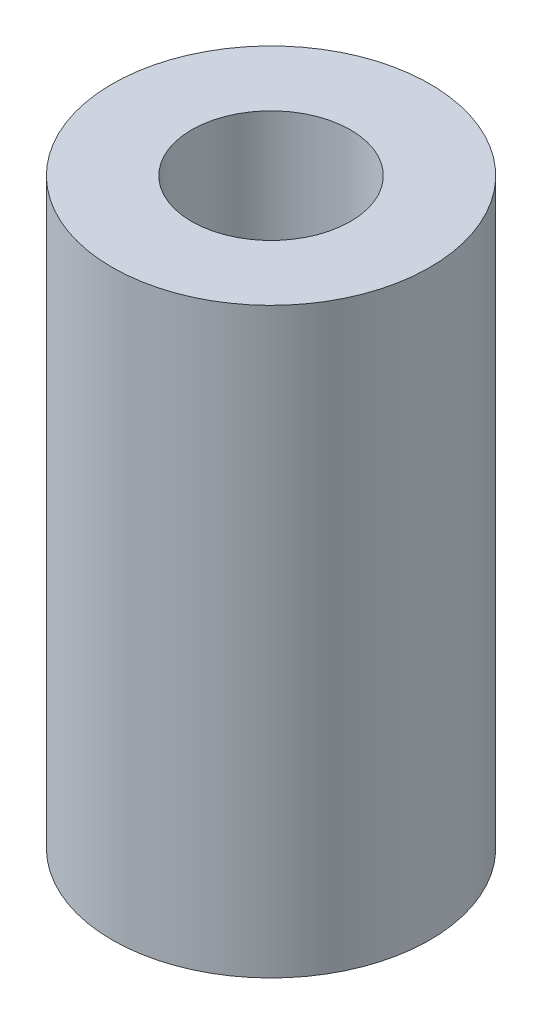
ISO-10303-21;
HEADER;
FILE_DESCRIPTION(('STEP AP214'),'2;1');
FILE_NAME('part.step','',(''),(''),'','','');
FILE_SCHEMA(('AUTOMOTIVE_DESIGN { 1 0 10303 214 1 1 1 1 }'));
ENDSEC;
DATA;
#1=APPLICATION_CONTEXT('core data for automotive mechanical design processes');
#2=APPLICATION_PROTOCOL_DEFINITION('international standard','automotive_design',2000,#1);
#3=PRODUCT_CONTEXT('',#1,'mechanical');
#4=PRODUCT('Part','Part','',(#3));
#5=PRODUCT_RELATED_PRODUCT_CATEGORY('part','',(#4));
#6=PRODUCT_DEFINITION_FORMATION('','',#4);
#7=PRODUCT_DEFINITION_CONTEXT('part definition',#1,'design');
#8=PRODUCT_DEFINITION('design','',#6,#7);
#9=PRODUCT_DEFINITION_SHAPE('','',#8);
#10=(LENGTH_UNIT() NAMED_UNIT(*) SI_UNIT(.MILLI.,.METRE.));
#11=(NAMED_UNIT(*) PLANE_ANGLE_UNIT() SI_UNIT($,.RADIAN.));
#12=(NAMED_UNIT(*) SI_UNIT($,.STERADIAN.) SOLID_ANGLE_UNIT());
#13=UNCERTAINTY_MEASURE_WITH_UNIT(LENGTH_MEASURE(1.E-05),#10,'distance_accuracy_value','');
#14=(GEOMETRIC_REPRESENTATION_CONTEXT(3) GLOBAL_UNCERTAINTY_ASSIGNED_CONTEXT((#13)) GLOBAL_UNIT_ASSIGNED_CONTEXT((#10,
#11,#12)) REPRESENTATION_CONTEXT('',''));
#15=CARTESIAN_POINT('',(0.,0.,0.));
#16=DIRECTION('',(0.,0.,1.));
#17=DIRECTION('',(1.,0.,0.));
#18=AXIS2_PLACEMENT_3D('',#15,#16,#17);
#19=CARTESIAN_POINT('',(0.,22.,0.));
#20=DIRECTION('',(0.,-1.,0.));
#21=DIRECTION('',(0.,0.,-1.));
#22=AXIS2_PLACEMENT_3D('',#19,#20,#21);
#23=CYLINDRICAL_SURFACE('',#22,6.);
#24=CARTESIAN_POINT('',(0.,22.,0.));
#25=DIRECTION('',(0.,1.,0.));
#26=DIRECTION('',(0.,0.,1.));
#27=AXIS2_PLACEMENT_3D('',#24,#25,#26);
#28=CIRCLE('',#27,6.);
#29=CARTESIAN_POINT('',(0.,22.,6.));
#30=VERTEX_POINT('',#29);
#31=EDGE_CURVE('E12',#30,#30,#28,.T.);
#32=ORIENTED_EDGE('',*,*,#31,.F.);
#33=EDGE_LOOP('',(#32));
#34=FACE_BOUND('',#33,.T.);
#35=CARTESIAN_POINT('',(0.,0.,0.));
#36=DIRECTION('',(0.,1.,0.));
#37=DIRECTION('',(0.,0.,1.));
#38=AXIS2_PLACEMENT_3D('',#35,#36,#37);
#39=CIRCLE('',#38,6.);
#40=CARTESIAN_POINT('',(0.,0.,6.));
#41=VERTEX_POINT('',#40);
#42=EDGE_CURVE('E47',#41,#41,#39,.T.);
#43=ORIENTED_EDGE('',*,*,#42,.T.);
#44=EDGE_LOOP('',(#43));
#45=FACE_BOUND('',#44,.T.);
#46=ADVANCED_FACE('F44',(#34,#45),#23,.T.);
#47=CARTESIAN_POINT('',(0.,22.,0.));
#48=DIRECTION('',(0.,1.,0.));
#49=DIRECTION('',(0.,0.,1.));
#50=AXIS2_PLACEMENT_3D('',#47,#48,#49);
#51=PLANE('',#50);
#52=CARTESIAN_POINT('',(0.,22.,0.));
#53=DIRECTION('',(0.,1.,0.));
#54=DIRECTION('',(0.,0.,1.));
#55=AXIS2_PLACEMENT_3D('',#52,#53,#54);
#56=CIRCLE('',#55,3.);
#57=CARTESIAN_POINT('',(0.,22.,3.));
#58=VERTEX_POINT('',#57);
#59=EDGE_CURVE('E56',#58,#58,#56,.T.);
#60=ORIENTED_EDGE('',*,*,#59,.F.);
#61=EDGE_LOOP('',(#60));
#62=FACE_BOUND('',#61,.T.);
#63=ORIENTED_EDGE('',*,*,#31,.T.);
#64=EDGE_LOOP('',(#63));
#65=FACE_BOUND('',#64,.T.);
#66=ADVANCED_FACE('F71',(#62,#65),#51,.T.);
#67=CARTESIAN_POINT('',(0.,0.,0.));
#68=DIRECTION('',(0.,1.,0.));
#69=DIRECTION('',(0.,0.,1.));
#70=AXIS2_PLACEMENT_3D('',#67,#68,#69);
#71=PLANE('',#70);
#72=CARTESIAN_POINT('',(0.,0.,0.));
#73=DIRECTION('',(0.,1.,0.));
#74=DIRECTION('',(0.,0.,1.));
#75=AXIS2_PLACEMENT_3D('',#72,#73,#74);
#76=CIRCLE('',#75,3.);
#77=CARTESIAN_POINT('',(0.,0.,3.));
#78=VERTEX_POINT('',#77);
#79=EDGE_CURVE('E54',#78,#78,#76,.T.);
#80=ORIENTED_EDGE('',*,*,#79,.T.);
#81=EDGE_LOOP('',(#80));
#82=FACE_BOUND('',#81,.T.);
#83=ORIENTED_EDGE('',*,*,#42,.F.);
#84=EDGE_LOOP('',(#83));
#85=FACE_BOUND('',#84,.T.);
#86=ADVANCED_FACE('F62',(#82,#85),#71,.F.);
#87=CARTESIAN_POINT('',(0.,0.,0.));
#88=DIRECTION('',(0.,1.,0.));
#89=DIRECTION('',(0.,0.,1.));
#90=AXIS2_PLACEMENT_3D('',#87,#88,#89);
#91=CYLINDRICAL_SURFACE('',#90,3.);
#92=ORIENTED_EDGE('',*,*,#79,.F.);
#93=EDGE_LOOP('',(#92));
#94=FACE_BOUND('',#93,.T.);
#95=ORIENTED_EDGE('',*,*,#59,.T.);
#96=EDGE_LOOP('',(#95));
#97=FACE_BOUND('',#96,.T.);
#98=ADVANCED_FACE('F65',(#94,#97),#91,.F.);
#99=CLOSED_SHELL('',(#46,#66,#86,#98));
#100=MANIFOLD_SOLID_BREP('B2',#99);
#101=ADVANCED_BREP_SHAPE_REPRESENTATION('',(#18,#100),#14);
#102=SHAPE_DEFINITION_REPRESENTATION(#9,#101);
ENDSEC;
END-ISO-10303-21;
